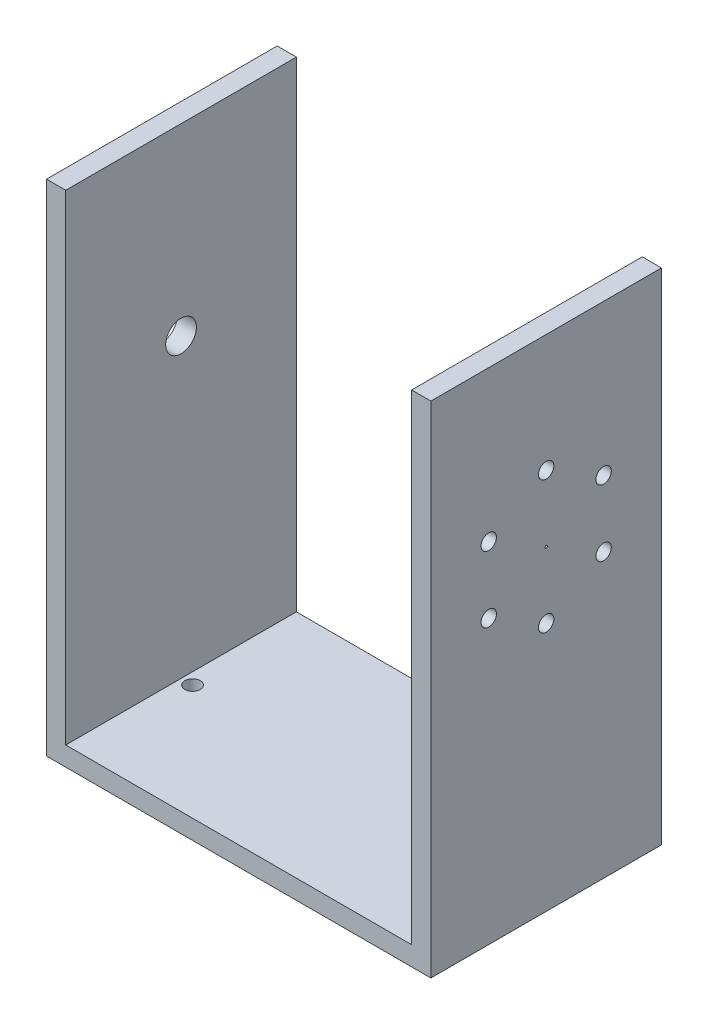
ISO-10303-21;
HEADER;
FILE_DESCRIPTION(('STEP AP214'),'2;1');
FILE_NAME('part.step','',(''),(''),'','','');
FILE_SCHEMA(('AUTOMOTIVE_DESIGN { 1 0 10303 214 1 1 1 1 }'));
ENDSEC;
DATA;
#1=APPLICATION_CONTEXT('core data for automotive mechanical design processes');
#2=APPLICATION_PROTOCOL_DEFINITION('international standard','automotive_design',2000,#1);
#3=PRODUCT_CONTEXT('',#1,'mechanical');
#4=PRODUCT('Part','Part','',(#3));
#5=PRODUCT_RELATED_PRODUCT_CATEGORY('part','',(#4));
#6=PRODUCT_DEFINITION_FORMATION('','',#4);
#7=PRODUCT_DEFINITION_CONTEXT('part definition',#1,'design');
#8=PRODUCT_DEFINITION('design','',#6,#7);
#9=PRODUCT_DEFINITION_SHAPE('','',#8);
#10=(LENGTH_UNIT() NAMED_UNIT(*) SI_UNIT(.MILLI.,.METRE.));
#11=(NAMED_UNIT(*) PLANE_ANGLE_UNIT() SI_UNIT($,.RADIAN.));
#12=(NAMED_UNIT(*) SI_UNIT($,.STERADIAN.) SOLID_ANGLE_UNIT());
#13=UNCERTAINTY_MEASURE_WITH_UNIT(LENGTH_MEASURE(1.E-05),#10,'distance_accuracy_value','');
#14=(GEOMETRIC_REPRESENTATION_CONTEXT(3) GLOBAL_UNCERTAINTY_ASSIGNED_CONTEXT((#13)) GLOBAL_UNIT_ASSIGNED_CONTEXT((#10,
#11,#12)) REPRESENTATION_CONTEXT('',''));
#15=CARTESIAN_POINT('',(0.,0.,0.));
#16=DIRECTION('',(0.,0.,1.));
#17=DIRECTION('',(1.,0.,0.));
#18=AXIS2_PLACEMENT_3D('',#15,#16,#17);
#19=CARTESIAN_POINT('',(-4.99999999999998,-81.8372783894152,60.));
#20=DIRECTION('',(0.,1.,0.));
#21=DIRECTION('',(0.,0.,1.));
#22=AXIS2_PLACEMENT_3D('',#19,#20,#21);
#23=PLANE('',#22);
#24=CARTESIAN_POINT('',(3.00000000000002,-81.8372783894152,30.));
#25=DIRECTION('',(0.,1.,0.));
#26=DIRECTION('',(-1.,0.,0.));
#27=AXIS2_PLACEMENT_3D('',#24,#25,#26);
#28=CIRCLE('',#27,2.);
#29=CARTESIAN_POINT('',(1.00000000000001,-81.8372783894152,30.));
#30=VERTEX_POINT('',#29);
#31=EDGE_CURVE('E139',#30,#30,#28,.T.);
#32=ORIENTED_EDGE('',*,*,#31,.T.);
#33=EDGE_LOOP('',(#32));
#34=FACE_BOUND('',#33,.T.);
#35=CARTESIAN_POINT('',(87.,-81.8372783894152,30.));
#36=DIRECTION('',(0.,1.,0.));
#37=DIRECTION('',(-1.,0.,0.));
#38=AXIS2_PLACEMENT_3D('',#35,#36,#37);
#39=CIRCLE('',#38,2.);
#40=CARTESIAN_POINT('',(85.,-81.8372783894152,30.));
#41=VERTEX_POINT('',#40);
#42=EDGE_CURVE('E183',#41,#41,#39,.T.);
#43=ORIENTED_EDGE('',*,*,#42,.T.);
#44=EDGE_LOOP('',(#43));
#45=FACE_BOUND('',#44,.T.);
#46=DIRECTION('',(1.,0.,0.));
#47=VECTOR('',#46,1.);
#48=CARTESIAN_POINT('',(-4.99999999999998,-81.8372783894152,0.));
#49=LINE('',#48,#47);
#50=CARTESIAN_POINT('',(-4.99999999999998,-81.8372783894152,0.));
#51=VERTEX_POINT('',#50);
#52=CARTESIAN_POINT('',(95.,-81.8372783894152,0.));
#53=VERTEX_POINT('',#52);
#54=EDGE_CURVE('E135',#51,#53,#49,.T.);
#55=ORIENTED_EDGE('',*,*,#54,.T.);
#56=DIRECTION('',(0.,0.,-1.));
#57=VECTOR('',#56,1.);
#58=CARTESIAN_POINT('',(95.,-81.8372783894152,60.));
#59=LINE('',#58,#57);
#60=CARTESIAN_POINT('',(95.,-81.8372783894152,60.));
#61=VERTEX_POINT('',#60);
#62=EDGE_CURVE('E11',#61,#53,#59,.T.);
#63=ORIENTED_EDGE('',*,*,#62,.F.);
#64=DIRECTION('',(1.,0.,0.));
#65=VECTOR('',#64,1.);
#66=CARTESIAN_POINT('',(-4.99999999999998,-81.8372783894152,60.));
#67=LINE('',#66,#65);
#68=CARTESIAN_POINT('',(-4.99999999999998,-81.8372783894152,60.));
#69=VERTEX_POINT('',#68);
#70=EDGE_CURVE('E150',#69,#61,#67,.T.);
#71=ORIENTED_EDGE('',*,*,#70,.F.);
#72=DIRECTION('',(0.,0.,-1.));
#73=VECTOR('',#72,1.);
#74=CARTESIAN_POINT('',(-4.99999999999998,-81.8372783894152,60.));
#75=LINE('',#74,#73);
#76=EDGE_CURVE('E131',#69,#51,#75,.T.);
#77=ORIENTED_EDGE('',*,*,#76,.T.);
#78=EDGE_LOOP('',(#55,#63,#71,#77));
#79=FACE_BOUND('',#78,.T.);
#80=ADVANCED_FACE('F39',(#34,#45,#79),#23,.F.);
#81=CARTESIAN_POINT('',(95.,-81.8372783894152,60.));
#82=DIRECTION('',(-1.,0.,0.));
#83=DIRECTION('',(0.,0.,1.));
#84=AXIS2_PLACEMENT_3D('',#81,#82,#83);
#85=PLANE('',#84);
#86=CARTESIAN_POINT('',(95.,17.5824130230406,30.));
#87=DIRECTION('',(-1.,0.,0.));
#88=DIRECTION('',(0.,0.,1.));
#89=AXIS2_PLACEMENT_3D('',#86,#87,#88);
#90=CIRCLE('',#89,2.);
#91=CARTESIAN_POINT('',(95.,17.5824130230406,32.));
#92=VERTEX_POINT('',#91);
#93=EDGE_CURVE('E187',#92,#92,#90,.T.);
#94=ORIENTED_EDGE('',*,*,#93,.T.);
#95=EDGE_LOOP('',(#94));
#96=FACE_BOUND('',#95,.T.);
#97=CARTESIAN_POINT('',(95.,0.331360805292724,30.0000000000148));
#98=DIRECTION('',(-1.,0.,0.));
#99=DIRECTION('',(0.,0.,1.));
#100=AXIS2_PLACEMENT_3D('',#97,#98,#99);
#101=CIRCLE('',#100,0.323841849644251);
#102=CARTESIAN_POINT('',(95.,0.331360805292724,30.323841849659));
#103=VERTEX_POINT('',#102);
#104=EDGE_CURVE('E197',#103,#103,#101,.T.);
#105=ORIENTED_EDGE('',*,*,#104,.T.);
#106=EDGE_LOOP('',(#105));
#107=FACE_BOUND('',#106,.T.);
#108=CARTESIAN_POINT('',(95.,8.9568869141534,15.0601505374261));
#109=DIRECTION('',(-1.,0.,0.));
#110=DIRECTION('',(0.,0.,1.));
#111=AXIS2_PLACEMENT_3D('',#108,#109,#110);
#112=CIRCLE('',#111,2.00000000000001);
#113=CARTESIAN_POINT('',(95.,8.9568869141534,17.0601505374261));
#114=VERTEX_POINT('',#113);
#115=EDGE_CURVE('E200',#114,#114,#112,.T.);
#116=ORIENTED_EDGE('',*,*,#115,.T.);
#117=EDGE_LOOP('',(#116));
#118=FACE_BOUND('',#117,.T.);
#119=CARTESIAN_POINT('',(95.,-8.29416530359448,15.0601505374414));
#120=DIRECTION('',(-1.,0.,0.));
#121=DIRECTION('',(0.,0.,1.));
#122=AXIS2_PLACEMENT_3D('',#119,#120,#121);
#123=CIRCLE('',#122,2.);
#124=CARTESIAN_POINT('',(95.,-8.29416530359448,17.0601505374414));
#125=VERTEX_POINT('',#124);
#126=EDGE_CURVE('E203',#125,#125,#123,.T.);
#127=ORIENTED_EDGE('',*,*,#126,.T.);
#128=EDGE_LOOP('',(#127));
#129=FACE_BOUND('',#128,.T.);
#130=CARTESIAN_POINT('',(95.,-16.9196914124551,30.0000000000306));
#131=DIRECTION('',(-1.,0.,0.));
#132=DIRECTION('',(0.,0.,1.));
#133=AXIS2_PLACEMENT_3D('',#130,#131,#132);
#134=CIRCLE('',#133,2.);
#135=CARTESIAN_POINT('',(95.,-16.9196914124551,32.0000000000306));
#136=VERTEX_POINT('',#135);
#137=EDGE_CURVE('E206',#136,#136,#134,.T.);
#138=ORIENTED_EDGE('',*,*,#137,.T.);
#139=EDGE_LOOP('',(#138));
#140=FACE_BOUND('',#139,.T.);
#141=CARTESIAN_POINT('',(95.,-8.29416530356785,44.9398494626045));
#142=DIRECTION('',(-1.,0.,0.));
#143=DIRECTION('',(0.,0.,1.));
#144=AXIS2_PLACEMENT_3D('',#141,#142,#143);
#145=CIRCLE('',#144,2.);
#146=CARTESIAN_POINT('',(95.,-8.29416530356785,46.9398494626045));
#147=VERTEX_POINT('',#146);
#148=EDGE_CURVE('E209',#147,#147,#145,.T.);
#149=ORIENTED_EDGE('',*,*,#148,.T.);
#150=EDGE_LOOP('',(#149));
#151=FACE_BOUND('',#150,.T.);
#152=CARTESIAN_POINT('',(95.,8.95688691418002,44.939849462589));
#153=DIRECTION('',(-1.,0.,0.));
#154=DIRECTION('',(0.,0.,1.));
#155=AXIS2_PLACEMENT_3D('',#152,#153,#154);
#156=CIRCLE('',#155,2.);
#157=CARTESIAN_POINT('',(95.,8.95688691418002,46.939849462589));
#158=VERTEX_POINT('',#157);
#159=EDGE_CURVE('E212',#158,#158,#156,.T.);
#160=ORIENTED_EDGE('',*,*,#159,.T.);
#161=EDGE_LOOP('',(#160));
#162=FACE_BOUND('',#161,.T.);
#163=DIRECTION('',(0.,1.,0.));
#164=VECTOR('',#163,1.);
#165=CARTESIAN_POINT('',(95.,-81.8372783894152,0.));
#166=LINE('',#165,#164);
#167=CARTESIAN_POINT('',(95.,48.1627216105848,0.));
#168=VERTEX_POINT('',#167);
#169=EDGE_CURVE('E138',#53,#168,#166,.T.);
#170=ORIENTED_EDGE('',*,*,#169,.T.);
#171=DIRECTION('',(0.,0.,-1.));
#172=VECTOR('',#171,1.);
#173=CARTESIAN_POINT('',(95.,48.1627216105848,60.));
#174=LINE('',#173,#172);
#175=CARTESIAN_POINT('',(95.,48.1627216105848,60.));
#176=VERTEX_POINT('',#175);
#177=EDGE_CURVE('E47',#176,#168,#174,.T.);
#178=ORIENTED_EDGE('',*,*,#177,.F.);
#179=DIRECTION('',(0.,1.,0.));
#180=VECTOR('',#179,1.);
#181=CARTESIAN_POINT('',(95.,-81.8372783894152,60.));
#182=LINE('',#181,#180);
#183=EDGE_CURVE('E98',#61,#176,#182,.T.);
#184=ORIENTED_EDGE('',*,*,#183,.F.);
#185=ORIENTED_EDGE('',*,*,#62,.T.);
#186=EDGE_LOOP('',(#170,#178,#184,#185));
#187=FACE_BOUND('',#186,.T.);
#188=ADVANCED_FACE('F262',(#96,#107,#118,#129,#140,#151,#162,#187),#85,.F.);
#189=CARTESIAN_POINT('',(95.,48.1627216105848,60.));
#190=DIRECTION('',(0.,-1.,0.));
#191=DIRECTION('',(1.,0.,0.));
#192=AXIS2_PLACEMENT_3D('',#189,#190,#191);
#193=PLANE('',#192);
#194=DIRECTION('',(-1.,0.,0.));
#195=VECTOR('',#194,1.);
#196=CARTESIAN_POINT('',(95.,48.1627216105848,0.));
#197=LINE('',#196,#195);
#198=CARTESIAN_POINT('',(90.,48.1627216105848,0.));
#199=VERTEX_POINT('',#198);
#200=EDGE_CURVE('E141',#168,#199,#197,.T.);
#201=ORIENTED_EDGE('',*,*,#200,.T.);
#202=DIRECTION('',(0.,0.,-1.));
#203=VECTOR('',#202,1.);
#204=CARTESIAN_POINT('',(90.,48.1627216105848,60.));
#205=LINE('',#204,#203);
#206=CARTESIAN_POINT('',(90.,48.1627216105848,60.));
#207=VERTEX_POINT('',#206);
#208=EDGE_CURVE('E157',#207,#199,#205,.T.);
#209=ORIENTED_EDGE('',*,*,#208,.F.);
#210=DIRECTION('',(-1.,0.,0.));
#211=VECTOR('',#210,1.);
#212=CARTESIAN_POINT('',(95.,48.1627216105848,60.));
#213=LINE('',#212,#211);
#214=EDGE_CURVE('E165',#176,#207,#213,.T.);
#215=ORIENTED_EDGE('',*,*,#214,.F.);
#216=ORIENTED_EDGE('',*,*,#177,.T.);
#217=EDGE_LOOP('',(#201,#209,#215,#216));
#218=FACE_BOUND('',#217,.T.);
#219=ADVANCED_FACE('F163',(#218),#193,.F.);
#220=CARTESIAN_POINT('',(90.,48.1627216105848,60.));
#221=DIRECTION('',(1.,0.,0.));
#222=DIRECTION('',(0.,1.,0.));
#223=AXIS2_PLACEMENT_3D('',#220,#221,#222);
#224=PLANE('',#223);
#225=CARTESIAN_POINT('',(90.,17.5824130230406,30.));
#226=DIRECTION('',(-1.,0.,0.));
#227=DIRECTION('',(0.,0.,1.));
#228=AXIS2_PLACEMENT_3D('',#225,#226,#227);
#229=CIRCLE('',#228,2.);
#230=CARTESIAN_POINT('',(90.,17.5824130230406,32.));
#231=VERTEX_POINT('',#230);
#232=EDGE_CURVE('E215',#231,#231,#229,.T.);
#233=ORIENTED_EDGE('',*,*,#232,.F.);
#234=EDGE_LOOP('',(#233));
#235=FACE_BOUND('',#234,.T.);
#236=CARTESIAN_POINT('',(90.,0.331360805292724,30.0000000000148));
#237=DIRECTION('',(-1.,0.,0.));
#238=DIRECTION('',(0.,0.,1.));
#239=AXIS2_PLACEMENT_3D('',#236,#237,#238);
#240=CIRCLE('',#239,0.323841849644251);
#241=CARTESIAN_POINT('',(90.,0.331360805292724,30.323841849659));
#242=VERTEX_POINT('',#241);
#243=EDGE_CURVE('E232',#242,#242,#240,.T.);
#244=ORIENTED_EDGE('',*,*,#243,.F.);
#245=EDGE_LOOP('',(#244));
#246=FACE_BOUND('',#245,.T.);
#247=CARTESIAN_POINT('',(90.,8.9568869141534,15.0601505374261));
#248=DIRECTION('',(-1.,0.,0.));
#249=DIRECTION('',(0.,0.,1.));
#250=AXIS2_PLACEMENT_3D('',#247,#248,#249);
#251=CIRCLE('',#250,2.00000000000001);
#252=CARTESIAN_POINT('',(90.,8.9568869141534,17.0601505374261));
#253=VERTEX_POINT('',#252);
#254=EDGE_CURVE('E229',#253,#253,#251,.T.);
#255=ORIENTED_EDGE('',*,*,#254,.F.);
#256=EDGE_LOOP('',(#255));
#257=FACE_BOUND('',#256,.T.);
#258=CARTESIAN_POINT('',(90.,-8.29416530359448,15.0601505374414));
#259=DIRECTION('',(-1.,0.,0.));
#260=DIRECTION('',(0.,0.,1.));
#261=AXIS2_PLACEMENT_3D('',#258,#259,#260);
#262=CIRCLE('',#261,2.);
#263=CARTESIAN_POINT('',(90.,-8.29416530359448,17.0601505374414));
#264=VERTEX_POINT('',#263);
#265=EDGE_CURVE('E226',#264,#264,#262,.T.);
#266=ORIENTED_EDGE('',*,*,#265,.F.);
#267=EDGE_LOOP('',(#266));
#268=FACE_BOUND('',#267,.T.);
#269=CARTESIAN_POINT('',(90.,-16.9196914124551,30.0000000000306));
#270=DIRECTION('',(-1.,0.,0.));
#271=DIRECTION('',(0.,0.,1.));
#272=AXIS2_PLACEMENT_3D('',#269,#270,#271);
#273=CIRCLE('',#272,2.);
#274=CARTESIAN_POINT('',(90.,-16.9196914124551,32.0000000000306));
#275=VERTEX_POINT('',#274);
#276=EDGE_CURVE('E223',#275,#275,#273,.T.);
#277=ORIENTED_EDGE('',*,*,#276,.F.);
#278=EDGE_LOOP('',(#277));
#279=FACE_BOUND('',#278,.T.);
#280=CARTESIAN_POINT('',(90.,-8.29416530356785,44.9398494626045));
#281=DIRECTION('',(-1.,0.,0.));
#282=DIRECTION('',(0.,0.,1.));
#283=AXIS2_PLACEMENT_3D('',#280,#281,#282);
#284=CIRCLE('',#283,2.);
#285=CARTESIAN_POINT('',(90.,-8.29416530356785,46.9398494626045));
#286=VERTEX_POINT('',#285);
#287=EDGE_CURVE('E219',#286,#286,#284,.T.);
#288=ORIENTED_EDGE('',*,*,#287,.F.);
#289=EDGE_LOOP('',(#288));
#290=FACE_BOUND('',#289,.T.);
#291=CARTESIAN_POINT('',(90.,8.95688691418002,44.939849462589));
#292=DIRECTION('',(-1.,0.,0.));
#293=DIRECTION('',(0.,0.,1.));
#294=AXIS2_PLACEMENT_3D('',#291,#292,#293);
#295=CIRCLE('',#294,2.);
#296=CARTESIAN_POINT('',(90.,8.95688691418002,46.939849462589));
#297=VERTEX_POINT('',#296);
#298=EDGE_CURVE('E216',#297,#297,#295,.T.);
#299=ORIENTED_EDGE('',*,*,#298,.F.);
#300=EDGE_LOOP('',(#299));
#301=FACE_BOUND('',#300,.T.);
#302=DIRECTION('',(0.,-1.,0.));
#303=VECTOR('',#302,1.);
#304=CARTESIAN_POINT('',(90.,48.1627216105848,0.));
#305=LINE('',#304,#303);
#306=CARTESIAN_POINT('',(90.,-76.8372783894152,0.));
#307=VERTEX_POINT('',#306);
#308=EDGE_CURVE('E143',#199,#307,#305,.T.);
#309=ORIENTED_EDGE('',*,*,#308,.T.);
#310=DIRECTION('',(0.,0.,-1.));
#311=VECTOR('',#310,1.);
#312=CARTESIAN_POINT('',(90.,-76.8372783894152,60.));
#313=LINE('',#312,#311);
#314=CARTESIAN_POINT('',(90.,-76.8372783894152,60.));
#315=VERTEX_POINT('',#314);
#316=EDGE_CURVE('E154',#315,#307,#313,.T.);
#317=ORIENTED_EDGE('',*,*,#316,.F.);
#318=DIRECTION('',(0.,-1.,0.));
#319=VECTOR('',#318,1.);
#320=CARTESIAN_POINT('',(90.,48.1627216105848,60.));
#321=LINE('',#320,#319);
#322=EDGE_CURVE('E177',#207,#315,#321,.T.);
#323=ORIENTED_EDGE('',*,*,#322,.F.);
#324=ORIENTED_EDGE('',*,*,#208,.T.);
#325=EDGE_LOOP('',(#309,#317,#323,#324));
#326=FACE_BOUND('',#325,.T.);
#327=ADVANCED_FACE('F173',(#235,#246,#257,#268,#279,#290,#301,#326),#224,.F.);
#328=CARTESIAN_POINT('',(90.,-76.8372783894152,60.));
#329=DIRECTION('',(0.,-1.,0.));
#330=DIRECTION('',(1.,0.,0.));
#331=AXIS2_PLACEMENT_3D('',#328,#329,#330);
#332=PLANE('',#331);
#333=CARTESIAN_POINT('',(3.00000000000002,-76.8372783894152,30.));
#334=DIRECTION('',(0.,1.,0.));
#335=DIRECTION('',(-1.,0.,0.));
#336=AXIS2_PLACEMENT_3D('',#333,#334,#335);
#337=CIRCLE('',#336,2.);
#338=CARTESIAN_POINT('',(1.00000000000001,-76.8372783894152,30.));
#339=VERTEX_POINT('',#338);
#340=EDGE_CURVE('E190',#339,#339,#337,.T.);
#341=ORIENTED_EDGE('',*,*,#340,.F.);
#342=EDGE_LOOP('',(#341));
#343=FACE_BOUND('',#342,.T.);
#344=CARTESIAN_POINT('',(87.,-76.8372783894152,30.));
#345=DIRECTION('',(0.,1.,0.));
#346=DIRECTION('',(-1.,0.,0.));
#347=AXIS2_PLACEMENT_3D('',#344,#345,#346);
#348=CIRCLE('',#347,2.);
#349=CARTESIAN_POINT('',(85.,-76.8372783894152,30.));
#350=VERTEX_POINT('',#349);
#351=EDGE_CURVE('E186',#350,#350,#348,.T.);
#352=ORIENTED_EDGE('',*,*,#351,.F.);
#353=EDGE_LOOP('',(#352));
#354=FACE_BOUND('',#353,.T.);
#355=DIRECTION('',(-1.,0.,0.));
#356=VECTOR('',#355,1.);
#357=CARTESIAN_POINT('',(90.,-76.8372783894152,0.));
#358=LINE('',#357,#356);
#359=CARTESIAN_POINT('',(0.,-76.8372783894152,0.));
#360=VERTEX_POINT('',#359);
#361=EDGE_CURVE('E145',#307,#360,#358,.T.);
#362=ORIENTED_EDGE('',*,*,#361,.T.);
#363=DIRECTION('',(0.,0.,-1.));
#364=VECTOR('',#363,1.);
#365=CARTESIAN_POINT('',(0.,-76.8372783894152,60.));
#366=LINE('',#365,#364);
#367=CARTESIAN_POINT('',(0.,-76.8372783894152,60.));
#368=VERTEX_POINT('',#367);
#369=EDGE_CURVE('E126',#368,#360,#366,.T.);
#370=ORIENTED_EDGE('',*,*,#369,.F.);
#371=DIRECTION('',(-1.,0.,0.));
#372=VECTOR('',#371,1.);
#373=CARTESIAN_POINT('',(90.,-76.8372783894152,60.));
#374=LINE('',#373,#372);
#375=EDGE_CURVE('E117',#315,#368,#374,.T.);
#376=ORIENTED_EDGE('',*,*,#375,.F.);
#377=ORIENTED_EDGE('',*,*,#316,.T.);
#378=EDGE_LOOP('',(#362,#370,#376,#377));
#379=FACE_BOUND('',#378,.T.);
#380=ADVANCED_FACE('F176',(#343,#354,#379),#332,.F.);
#381=CARTESIAN_POINT('',(0.,-76.8372783894152,60.));
#382=DIRECTION('',(-1.,0.,0.));
#383=DIRECTION('',(0.,-1.,0.));
#384=AXIS2_PLACEMENT_3D('',#381,#382,#383);
#385=PLANE('',#384);
#386=CARTESIAN_POINT('',(0.,0.331360805292724,30.0000000000148));
#387=DIRECTION('',(1.,0.,0.));
#388=DIRECTION('',(0.,1.,0.));
#389=AXIS2_PLACEMENT_3D('',#386,#387,#388);
#390=CIRCLE('',#389,4.);
#391=CARTESIAN_POINT('',(0.,4.33136080529272,30.0000000000148));
#392=VERTEX_POINT('',#391);
#393=EDGE_CURVE('E237',#392,#392,#390,.T.);
#394=ORIENTED_EDGE('',*,*,#393,.F.);
#395=EDGE_LOOP('',(#394));
#396=FACE_BOUND('',#395,.T.);
#397=DIRECTION('',(0.,1.,0.));
#398=VECTOR('',#397,1.);
#399=CARTESIAN_POINT('',(0.,-76.8372783894152,0.));
#400=LINE('',#399,#398);
#401=CARTESIAN_POINT('',(0.,48.1627216105848,0.));
#402=VERTEX_POINT('',#401);
#403=EDGE_CURVE('E125',#360,#402,#400,.T.);
#404=ORIENTED_EDGE('',*,*,#403,.T.);
#405=DIRECTION('',(0.,0.,-1.));
#406=VECTOR('',#405,1.);
#407=CARTESIAN_POINT('',(0.,48.1627216105848,60.));
#408=LINE('',#407,#406);
#409=CARTESIAN_POINT('',(0.,48.1627216105848,60.));
#410=VERTEX_POINT('',#409);
#411=EDGE_CURVE('E122',#410,#402,#408,.T.);
#412=ORIENTED_EDGE('',*,*,#411,.F.);
#413=DIRECTION('',(0.,1.,0.));
#414=VECTOR('',#413,1.);
#415=CARTESIAN_POINT('',(0.,-76.8372783894152,60.));
#416=LINE('',#415,#414);
#417=EDGE_CURVE('E111',#368,#410,#416,.T.);
#418=ORIENTED_EDGE('',*,*,#417,.F.);
#419=ORIENTED_EDGE('',*,*,#369,.T.);
#420=EDGE_LOOP('',(#404,#412,#418,#419));
#421=FACE_BOUND('',#420,.T.);
#422=ADVANCED_FACE('F123',(#396,#421),#385,.F.);
#423=CARTESIAN_POINT('',(0.,48.1627216105848,60.));
#424=DIRECTION('',(0.,-1.,0.));
#425=DIRECTION('',(0.,0.,-1.));
#426=AXIS2_PLACEMENT_3D('',#423,#424,#425);
#427=PLANE('',#426);
#428=DIRECTION('',(-1.,0.,0.));
#429=VECTOR('',#428,1.);
#430=CARTESIAN_POINT('',(0.,48.1627216105848,0.));
#431=LINE('',#430,#429);
#432=CARTESIAN_POINT('',(-5.,48.1627216105848,0.));
#433=VERTEX_POINT('',#432);
#434=EDGE_CURVE('E84',#402,#433,#431,.T.);
#435=ORIENTED_EDGE('',*,*,#434,.T.);
#436=DIRECTION('',(0.,0.,-1.));
#437=VECTOR('',#436,1.);
#438=CARTESIAN_POINT('',(-5.,48.1627216105848,60.));
#439=LINE('',#438,#437);
#440=CARTESIAN_POINT('',(-5.,48.1627216105848,60.));
#441=VERTEX_POINT('',#440);
#442=EDGE_CURVE('E127',#441,#433,#439,.T.);
#443=ORIENTED_EDGE('',*,*,#442,.F.);
#444=DIRECTION('',(-1.,0.,0.));
#445=VECTOR('',#444,1.);
#446=CARTESIAN_POINT('',(0.,48.1627216105848,60.));
#447=LINE('',#446,#445);
#448=EDGE_CURVE('E115',#410,#441,#447,.T.);
#449=ORIENTED_EDGE('',*,*,#448,.F.);
#450=ORIENTED_EDGE('',*,*,#411,.T.);
#451=EDGE_LOOP('',(#435,#443,#449,#450));
#452=FACE_BOUND('',#451,.T.);
#453=ADVANCED_FACE('F129',(#452),#427,.F.);
#454=CARTESIAN_POINT('',(-5.,48.1627216105848,60.));
#455=DIRECTION('',(1.,0.,0.));
#456=DIRECTION('',(0.,1.,0.));
#457=AXIS2_PLACEMENT_3D('',#454,#455,#456);
#458=PLANE('',#457);
#459=CARTESIAN_POINT('',(-5.,0.331360805292724,30.0000000000148));
#460=DIRECTION('',(1.,0.,0.));
#461=DIRECTION('',(0.,1.,0.));
#462=AXIS2_PLACEMENT_3D('',#459,#460,#461);
#463=CIRCLE('',#462,4.);
#464=CARTESIAN_POINT('',(-5.,4.33136080529272,30.0000000000148));
#465=VERTEX_POINT('',#464);
#466=EDGE_CURVE('E220',#465,#465,#463,.T.);
#467=ORIENTED_EDGE('',*,*,#466,.T.);
#468=EDGE_LOOP('',(#467));
#469=FACE_BOUND('',#468,.T.);
#470=DIRECTION('',(0.,-1.,0.));
#471=VECTOR('',#470,1.);
#472=CARTESIAN_POINT('',(-5.,48.1627216105848,0.));
#473=LINE('',#472,#471);
#474=EDGE_CURVE('E90',#433,#51,#473,.T.);
#475=ORIENTED_EDGE('',*,*,#474,.T.);
#476=ORIENTED_EDGE('',*,*,#76,.F.);
#477=DIRECTION('',(0.,-1.,0.));
#478=VECTOR('',#477,1.);
#479=CARTESIAN_POINT('',(-5.,48.1627216105848,60.));
#480=LINE('',#479,#478);
#481=EDGE_CURVE('E55',#441,#69,#480,.T.);
#482=ORIENTED_EDGE('',*,*,#481,.F.);
#483=ORIENTED_EDGE('',*,*,#442,.T.);
#484=EDGE_LOOP('',(#475,#476,#482,#483));
#485=FACE_BOUND('',#484,.T.);
#486=ADVANCED_FACE('F243',(#469,#485),#458,.F.);
#487=CARTESIAN_POINT('',(0.,0.,60.));
#488=DIRECTION('',(0.,0.,1.));
#489=DIRECTION('',(1.,0.,0.));
#490=AXIS2_PLACEMENT_3D('',#487,#488,#489);
#491=PLANE('',#490);
#492=ORIENTED_EDGE('',*,*,#70,.T.);
#493=ORIENTED_EDGE('',*,*,#183,.T.);
#494=ORIENTED_EDGE('',*,*,#214,.T.);
#495=ORIENTED_EDGE('',*,*,#322,.T.);
#496=ORIENTED_EDGE('',*,*,#375,.T.);
#497=ORIENTED_EDGE('',*,*,#417,.T.);
#498=ORIENTED_EDGE('',*,*,#448,.T.);
#499=ORIENTED_EDGE('',*,*,#481,.T.);
#500=EDGE_LOOP('',(#492,#493,#494,#495,#496,#497,#498,#499));
#501=FACE_BOUND('',#500,.T.);
#502=ADVANCED_FACE('F113',(#501),#491,.T.);
#503=CARTESIAN_POINT('',(0.,0.,0.));
#504=DIRECTION('',(0.,0.,1.));
#505=DIRECTION('',(1.,0.,0.));
#506=AXIS2_PLACEMENT_3D('',#503,#504,#505);
#507=PLANE('',#506);
#508=ORIENTED_EDGE('',*,*,#54,.F.);
#509=ORIENTED_EDGE('',*,*,#474,.F.);
#510=ORIENTED_EDGE('',*,*,#434,.F.);
#511=ORIENTED_EDGE('',*,*,#403,.F.);
#512=ORIENTED_EDGE('',*,*,#361,.F.);
#513=ORIENTED_EDGE('',*,*,#308,.F.);
#514=ORIENTED_EDGE('',*,*,#200,.F.);
#515=ORIENTED_EDGE('',*,*,#169,.F.);
#516=EDGE_LOOP('',(#508,#509,#510,#511,#512,#513,#514,#515));
#517=FACE_BOUND('',#516,.T.);
#518=ADVANCED_FACE('F169',(#517),#507,.F.);
#519=CARTESIAN_POINT('',(87.,-81.8372783894152,30.));
#520=DIRECTION('',(0.,1.,0.));
#521=DIRECTION('',(-1.,0.,0.));
#522=AXIS2_PLACEMENT_3D('',#519,#520,#521);
#523=CYLINDRICAL_SURFACE('',#522,2.);
#524=ORIENTED_EDGE('',*,*,#42,.F.);
#525=EDGE_LOOP('',(#524));
#526=FACE_BOUND('',#525,.T.);
#527=ORIENTED_EDGE('',*,*,#351,.T.);
#528=EDGE_LOOP('',(#527));
#529=FACE_BOUND('',#528,.T.);
#530=ADVANCED_FACE('F282',(#526,#529),#523,.F.);
#531=CARTESIAN_POINT('',(3.00000000000002,-81.8372783894152,30.));
#532=DIRECTION('',(0.,1.,0.));
#533=DIRECTION('',(-1.,0.,0.));
#534=AXIS2_PLACEMENT_3D('',#531,#532,#533);
#535=CYLINDRICAL_SURFACE('',#534,2.);
#536=ORIENTED_EDGE('',*,*,#31,.F.);
#537=EDGE_LOOP('',(#536));
#538=FACE_BOUND('',#537,.T.);
#539=ORIENTED_EDGE('',*,*,#340,.T.);
#540=EDGE_LOOP('',(#539));
#541=FACE_BOUND('',#540,.T.);
#542=ADVANCED_FACE('F286',(#538,#541),#535,.F.);
#543=CARTESIAN_POINT('',(100.,8.95688691418002,44.939849462589));
#544=DIRECTION('',(-1.,0.,0.));
#545=DIRECTION('',(0.,0.,1.));
#546=AXIS2_PLACEMENT_3D('',#543,#544,#545);
#547=CYLINDRICAL_SURFACE('',#546,2.);
#548=ORIENTED_EDGE('',*,*,#298,.T.);
#549=EDGE_LOOP('',(#548));
#550=FACE_BOUND('',#549,.T.);
#551=ORIENTED_EDGE('',*,*,#159,.F.);
#552=EDGE_LOOP('',(#551));
#553=FACE_BOUND('',#552,.T.);
#554=ADVANCED_FACE('F290',(#550,#553),#547,.F.);
#555=CARTESIAN_POINT('',(100.,-8.29416530356785,44.9398494626045));
#556=DIRECTION('',(-1.,0.,0.));
#557=DIRECTION('',(0.,0.,1.));
#558=AXIS2_PLACEMENT_3D('',#555,#556,#557);
#559=CYLINDRICAL_SURFACE('',#558,2.);
#560=ORIENTED_EDGE('',*,*,#287,.T.);
#561=EDGE_LOOP('',(#560));
#562=FACE_BOUND('',#561,.T.);
#563=ORIENTED_EDGE('',*,*,#148,.F.);
#564=EDGE_LOOP('',(#563));
#565=FACE_BOUND('',#564,.T.);
#566=ADVANCED_FACE('F294',(#562,#565),#559,.F.);
#567=CARTESIAN_POINT('',(100.,-16.9196914124551,30.0000000000306));
#568=DIRECTION('',(-1.,0.,0.));
#569=DIRECTION('',(0.,0.,1.));
#570=AXIS2_PLACEMENT_3D('',#567,#568,#569);
#571=CYLINDRICAL_SURFACE('',#570,2.);
#572=ORIENTED_EDGE('',*,*,#276,.T.);
#573=EDGE_LOOP('',(#572));
#574=FACE_BOUND('',#573,.T.);
#575=ORIENTED_EDGE('',*,*,#137,.F.);
#576=EDGE_LOOP('',(#575));
#577=FACE_BOUND('',#576,.T.);
#578=ADVANCED_FACE('F298',(#574,#577),#571,.F.);
#579=CARTESIAN_POINT('',(100.,-8.29416530359448,15.0601505374414));
#580=DIRECTION('',(-1.,0.,0.));
#581=DIRECTION('',(0.,0.,1.));
#582=AXIS2_PLACEMENT_3D('',#579,#580,#581);
#583=CYLINDRICAL_SURFACE('',#582,2.);
#584=ORIENTED_EDGE('',*,*,#265,.T.);
#585=EDGE_LOOP('',(#584));
#586=FACE_BOUND('',#585,.T.);
#587=ORIENTED_EDGE('',*,*,#126,.F.);
#588=EDGE_LOOP('',(#587));
#589=FACE_BOUND('',#588,.T.);
#590=ADVANCED_FACE('F302',(#586,#589),#583,.F.);
#591=CARTESIAN_POINT('',(100.,8.9568869141534,15.0601505374261));
#592=DIRECTION('',(-1.,0.,0.));
#593=DIRECTION('',(0.,0.,1.));
#594=AXIS2_PLACEMENT_3D('',#591,#592,#593);
#595=CYLINDRICAL_SURFACE('',#594,2.00000000000001);
#596=ORIENTED_EDGE('',*,*,#254,.T.);
#597=EDGE_LOOP('',(#596));
#598=FACE_BOUND('',#597,.T.);
#599=ORIENTED_EDGE('',*,*,#115,.F.);
#600=EDGE_LOOP('',(#599));
#601=FACE_BOUND('',#600,.T.);
#602=ADVANCED_FACE('F306',(#598,#601),#595,.F.);
#603=CARTESIAN_POINT('',(100.,0.331360805292724,30.0000000000148));
#604=DIRECTION('',(-1.,0.,0.));
#605=DIRECTION('',(0.,0.,1.));
#606=AXIS2_PLACEMENT_3D('',#603,#604,#605);
#607=CYLINDRICAL_SURFACE('',#606,0.323841849644251);
#608=ORIENTED_EDGE('',*,*,#243,.T.);
#609=EDGE_LOOP('',(#608));
#610=FACE_BOUND('',#609,.T.);
#611=ORIENTED_EDGE('',*,*,#104,.F.);
#612=EDGE_LOOP('',(#611));
#613=FACE_BOUND('',#612,.T.);
#614=ADVANCED_FACE('F310',(#610,#613),#607,.F.);
#615=CARTESIAN_POINT('',(100.,17.5824130230406,30.));
#616=DIRECTION('',(-1.,0.,0.));
#617=DIRECTION('',(0.,0.,1.));
#618=AXIS2_PLACEMENT_3D('',#615,#616,#617);
#619=CYLINDRICAL_SURFACE('',#618,2.);
#620=ORIENTED_EDGE('',*,*,#232,.T.);
#621=EDGE_LOOP('',(#620));
#622=FACE_BOUND('',#621,.T.);
#623=ORIENTED_EDGE('',*,*,#93,.F.);
#624=EDGE_LOOP('',(#623));
#625=FACE_BOUND('',#624,.T.);
#626=ADVANCED_FACE('F248',(#622,#625),#619,.F.);
#627=CARTESIAN_POINT('',(-5.,0.331360805292724,30.0000000000148));
#628=DIRECTION('',(1.,0.,0.));
#629=DIRECTION('',(0.,1.,0.));
#630=AXIS2_PLACEMENT_3D('',#627,#628,#629);
#631=CYLINDRICAL_SURFACE('',#630,4.);
#632=ORIENTED_EDGE('',*,*,#466,.F.);
#633=EDGE_LOOP('',(#632));
#634=FACE_BOUND('',#633,.T.);
#635=ORIENTED_EDGE('',*,*,#393,.T.);
#636=EDGE_LOOP('',(#635));
#637=FACE_BOUND('',#636,.T.);
#638=ADVANCED_FACE('F245',(#634,#637),#631,.F.);
#639=CLOSED_SHELL('',(#80,#188,#219,#327,#380,#422,#453,#486,#502,#518,#530,#542,#554,#566,#578,
#590,#602,#614,#626,#638));
#640=MANIFOLD_SOLID_BREP('B2',#639);
#641=ADVANCED_BREP_SHAPE_REPRESENTATION('',(#18,#640),#14);
#642=SHAPE_DEFINITION_REPRESENTATION(#9,#641);
ENDSEC;
END-ISO-10303-21;
